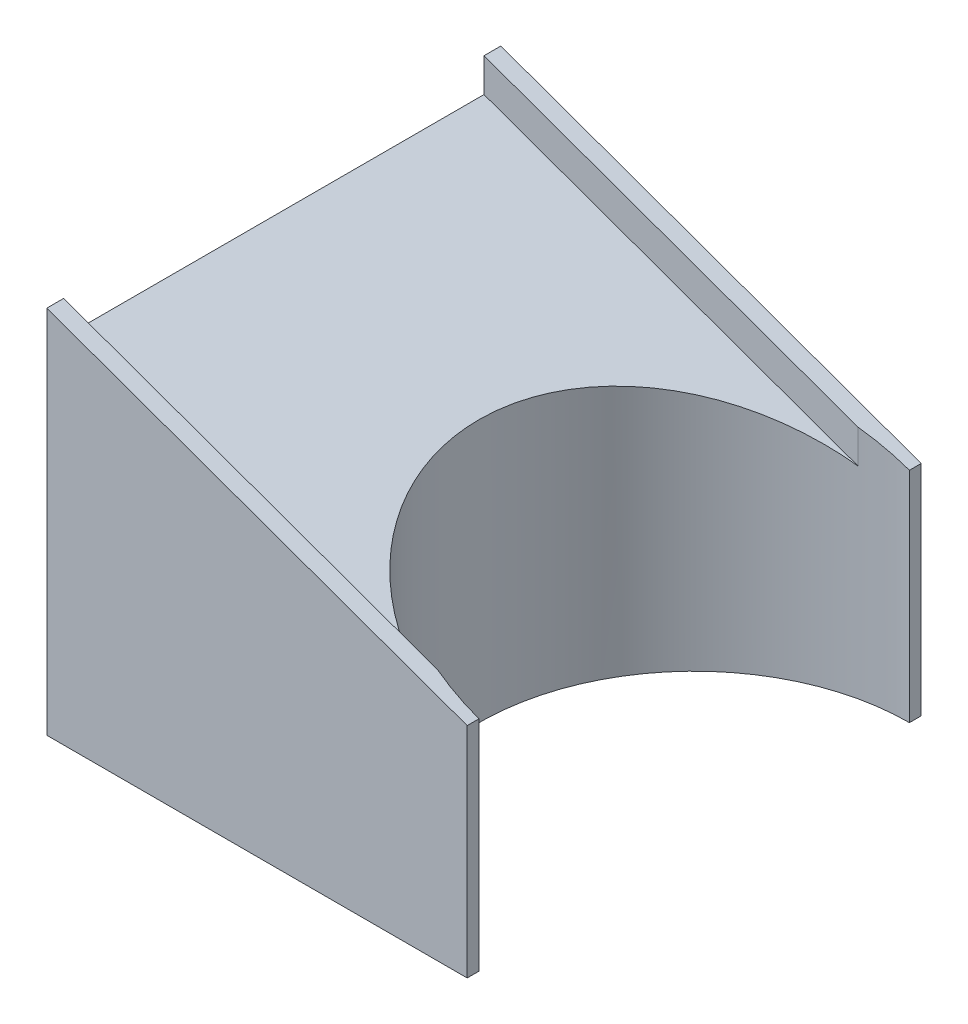
ISO-10303-21;
HEADER;
FILE_DESCRIPTION(('STEP AP214'),'2;1');
FILE_NAME('part.step','',(''),(''),'','','');
FILE_SCHEMA(('AUTOMOTIVE_DESIGN { 1 0 10303 214 1 1 1 1 }'));
ENDSEC;
DATA;
#1=APPLICATION_CONTEXT('core data for automotive mechanical design processes');
#2=APPLICATION_PROTOCOL_DEFINITION('international standard','automotive_design',2000,#1);
#3=PRODUCT_CONTEXT('',#1,'mechanical');
#4=PRODUCT('Part','Part','',(#3));
#5=PRODUCT_RELATED_PRODUCT_CATEGORY('part','',(#4));
#6=PRODUCT_DEFINITION_FORMATION('','',#4);
#7=PRODUCT_DEFINITION_CONTEXT('part definition',#1,'design');
#8=PRODUCT_DEFINITION('design','',#6,#7);
#9=PRODUCT_DEFINITION_SHAPE('','',#8);
#10=(LENGTH_UNIT() NAMED_UNIT(*) SI_UNIT(.MILLI.,.METRE.));
#11=(NAMED_UNIT(*) PLANE_ANGLE_UNIT() SI_UNIT($,.RADIAN.));
#12=(NAMED_UNIT(*) SI_UNIT($,.STERADIAN.) SOLID_ANGLE_UNIT());
#13=UNCERTAINTY_MEASURE_WITH_UNIT(LENGTH_MEASURE(1.E-05),#10,'distance_accuracy_value','');
#14=(GEOMETRIC_REPRESENTATION_CONTEXT(3) GLOBAL_UNCERTAINTY_ASSIGNED_CONTEXT((#13)) GLOBAL_UNIT_ASSIGNED_CONTEXT((#10,
#11,#12)) REPRESENTATION_CONTEXT('',''));
#15=CARTESIAN_POINT('',(0.,0.,0.));
#16=DIRECTION('',(0.,0.,1.));
#17=DIRECTION('',(1.,0.,0.));
#18=AXIS2_PLACEMENT_3D('',#15,#16,#17);
#19=CARTESIAN_POINT('',(125.,55.,62.5));
#20=DIRECTION('',(-1.,0.,0.));
#21=DIRECTION('',(0.,-1.,0.));
#22=AXIS2_PLACEMENT_3D('',#19,#20,#21);
#23=PLANE('',#22);
#24=DIRECTION('',(0.,0.,1.));
#25=VECTOR('',#24,1.);
#26=CARTESIAN_POINT('',(125.,65.,-67.5));
#27=LINE('',#26,#25);
#28=CARTESIAN_POINT('',(125.,65.,-67.5));
#29=VERTEX_POINT('',#28);
#30=CARTESIAN_POINT('',(125.,65.,-64.));
#31=VERTEX_POINT('',#30);
#32=EDGE_CURVE('E186',#29,#31,#27,.T.);
#33=ORIENTED_EDGE('',*,*,#32,.T.);
#34=DIRECTION('',(0.,-1.,0.));
#35=VECTOR('',#34,1.);
#36=CARTESIAN_POINT('',(125.,110.,-64.));
#37=LINE('',#36,#35);
#38=CARTESIAN_POINT('',(125.,0.,-64.));
#39=VERTEX_POINT('',#38);
#40=EDGE_CURVE('E53',#31,#39,#37,.T.);
#41=ORIENTED_EDGE('',*,*,#40,.T.);
#42=DIRECTION('',(0.,0.,-1.));
#43=VECTOR('',#42,1.);
#44=CARTESIAN_POINT('',(125.,0.,62.5));
#45=LINE('',#44,#43);
#46=CARTESIAN_POINT('',(125.,0.,-67.5));
#47=VERTEX_POINT('',#46);
#48=EDGE_CURVE('E239',#39,#47,#45,.T.);
#49=ORIENTED_EDGE('',*,*,#48,.T.);
#50=DIRECTION('',(0.,1.,0.));
#51=VECTOR('',#50,1.);
#52=CARTESIAN_POINT('',(125.,65.,-67.5));
#53=LINE('',#52,#51);
#54=EDGE_CURVE('E169',#47,#29,#53,.T.);
#55=ORIENTED_EDGE('',*,*,#54,.T.);
#56=EDGE_LOOP('',(#33,#41,#49,#55));
#57=FACE_BOUND('',#56,.T.);
#58=ADVANCED_FACE('F38',(#57),#23,.F.);
#59=CARTESIAN_POINT('',(125.,0.,62.5));
#60=DIRECTION('',(0.,1.,0.));
#61=DIRECTION('',(-1.,0.,0.));
#62=AXIS2_PLACEMENT_3D('',#59,#60,#61);
#63=PLANE('',#62);
#64=ORIENTED_EDGE('',*,*,#48,.F.);
#65=CARTESIAN_POINT('',(125.,0.,0.));
#66=DIRECTION('',(0.,-1.,0.));
#67=DIRECTION('',(1.,0.,0.));
#68=AXIS2_PLACEMENT_3D('',#65,#66,#67);
#69=CIRCLE('',#68,64.);
#70=CARTESIAN_POINT('',(125.,0.,64.));
#71=VERTEX_POINT('',#70);
#72=EDGE_CURVE('E146',#71,#39,#69,.T.);
#73=ORIENTED_EDGE('',*,*,#72,.F.);
#74=CARTESIAN_POINT('',(125.,0.,67.5));
#75=VERTEX_POINT('',#74);
#76=EDGE_CURVE('E47',#75,#71,#45,.T.);
#77=ORIENTED_EDGE('',*,*,#76,.F.);
#78=DIRECTION('',(1.,0.,0.));
#79=VECTOR('',#78,1.);
#80=CARTESIAN_POINT('',(125.,0.,67.5));
#81=LINE('',#80,#79);
#82=CARTESIAN_POINT('',(0.,0.,67.5));
#83=VERTEX_POINT('',#82);
#84=EDGE_CURVE('E211',#83,#75,#81,.T.);
#85=ORIENTED_EDGE('',*,*,#84,.F.);
#86=DIRECTION('',(0.,0.,-1.));
#87=VECTOR('',#86,1.);
#88=CARTESIAN_POINT('',(0.,0.,62.5));
#89=LINE('',#88,#87);
#90=CARTESIAN_POINT('',(0.,0.,-67.5));
#91=VERTEX_POINT('',#90);
#92=EDGE_CURVE('E231',#83,#91,#89,.T.);
#93=ORIENTED_EDGE('',*,*,#92,.T.);
#94=DIRECTION('',(1.,0.,0.));
#95=VECTOR('',#94,1.);
#96=CARTESIAN_POINT('',(125.,0.,-67.5));
#97=LINE('',#96,#95);
#98=EDGE_CURVE('E173',#91,#47,#97,.T.);
#99=ORIENTED_EDGE('',*,*,#98,.T.);
#100=EDGE_LOOP('',(#64,#73,#77,#85,#93,#99));
#101=FACE_BOUND('',#100,.T.);
#102=ADVANCED_FACE('F40',(#101),#63,.F.);
#103=ORIENTED_EDGE('',*,*,#76,.T.);
#104=DIRECTION('',(0.,-1.,0.));
#105=VECTOR('',#104,1.);
#106=CARTESIAN_POINT('',(125.,110.,64.));
#107=LINE('',#106,#105);
#108=CARTESIAN_POINT('',(125.,65.,64.));
#109=VERTEX_POINT('',#108);
#110=EDGE_CURVE('E164',#71,#109,#107,.F.);
#111=ORIENTED_EDGE('',*,*,#110,.T.);
#112=DIRECTION('',(0.,0.,-1.));
#113=VECTOR('',#112,1.);
#114=CARTESIAN_POINT('',(125.,65.,67.5));
#115=LINE('',#114,#113);
#116=CARTESIAN_POINT('',(125.,65.,67.5));
#117=VERTEX_POINT('',#116);
#118=EDGE_CURVE('E224',#117,#109,#115,.T.);
#119=ORIENTED_EDGE('',*,*,#118,.F.);
#120=DIRECTION('',(0.,1.,0.));
#121=VECTOR('',#120,1.);
#122=CARTESIAN_POINT('',(125.,65.,67.5));
#123=LINE('',#122,#121);
#124=EDGE_CURVE('E199',#75,#117,#123,.T.);
#125=ORIENTED_EDGE('',*,*,#124,.F.);
#126=EDGE_LOOP('',(#103,#111,#119,#125));
#127=FACE_BOUND('',#126,.T.);
#128=ADVANCED_FACE('F280',(#127),#23,.F.);
#129=CARTESIAN_POINT('',(0.,100.,62.5));
#130=DIRECTION('',(-0.338719468272742,-0.940887411868727,0.));
#131=DIRECTION('',(0.940887411868727,-0.338719468272742,0.));
#132=AXIS2_PLACEMENT_3D('',#129,#130,#131);
#133=PLANE('',#132);
#134=DIRECTION('',(-0.940887411868727,0.338719468272742,0.));
#135=VECTOR('',#134,1.);
#136=CARTESIAN_POINT('',(0.,100.,62.5));
#137=LINE('',#136,#135);
#138=CARTESIAN_POINT('',(111.225022686044,59.9589918330241,62.5));
#139=VERTEX_POINT('',#138);
#140=CARTESIAN_POINT('',(0.,100.,62.5));
#141=VERTEX_POINT('',#140);
#142=EDGE_CURVE('E228',#139,#141,#137,.T.);
#143=ORIENTED_EDGE('',*,*,#142,.F.);
#144=CARTESIAN_POINT('',(125.,55.,0.));
#145=DIRECTION('',(-0.338719468272742,-0.940887411868727,0.));
#146=DIRECTION('',(0.940887411868727,-0.338719468272742,0.));
#147=AXIS2_PLACEMENT_3D('',#144,#145,#146);
#148=ELLIPSE('',#147,68.0208909086025,64.);
#149=CARTESIAN_POINT('',(111.225022686044,59.9589918330241,-62.5));
#150=VERTEX_POINT('',#149);
#151=EDGE_CURVE('E152',#139,#150,#148,.T.);
#152=ORIENTED_EDGE('',*,*,#151,.T.);
#153=DIRECTION('',(-0.940887411868727,0.338719468272742,0.));
#154=VECTOR('',#153,1.);
#155=CARTESIAN_POINT('',(0.,100.,-62.5));
#156=LINE('',#155,#154);
#157=CARTESIAN_POINT('',(0.,100.,-62.5));
#158=VERTEX_POINT('',#157);
#159=EDGE_CURVE('E61',#150,#158,#156,.T.);
#160=ORIENTED_EDGE('',*,*,#159,.T.);
#161=DIRECTION('',(0.,0.,-1.));
#162=VECTOR('',#161,1.);
#163=CARTESIAN_POINT('',(0.,100.,62.5));
#164=LINE('',#163,#162);
#165=EDGE_CURVE('E236',#141,#158,#164,.T.);
#166=ORIENTED_EDGE('',*,*,#165,.F.);
#167=EDGE_LOOP('',(#143,#152,#160,#166));
#168=FACE_BOUND('',#167,.T.);
#169=ADVANCED_FACE('F271',(#168),#133,.F.);
#170=CARTESIAN_POINT('',(0.,0.,62.5));
#171=DIRECTION('',(1.,0.,0.));
#172=DIRECTION('',(0.,0.,-1.));
#173=AXIS2_PLACEMENT_3D('',#170,#171,#172);
#174=PLANE('',#173);
#175=CARTESIAN_POINT('',(0.,55.,0.));
#176=DIRECTION('',(-1.,0.,0.));
#177=DIRECTION('',(0.,0.,1.));
#178=AXIS2_PLACEMENT_3D('',#175,#176,#177);
#179=CIRCLE('',#178,2.38759999999999);
#180=CARTESIAN_POINT('',(0.,55.,2.38759999999999));
#181=VERTEX_POINT('',#180);
#182=EDGE_CURVE('E133',#181,#181,#179,.T.);
#183=ORIENTED_EDGE('',*,*,#182,.F.);
#184=EDGE_LOOP('',(#183));
#185=FACE_BOUND('',#184,.T.);
#186=CARTESIAN_POINT('',(0.,20.,0.));
#187=DIRECTION('',(-1.,0.,0.));
#188=DIRECTION('',(0.,0.,1.));
#189=AXIS2_PLACEMENT_3D('',#186,#187,#188);
#190=CIRCLE('',#189,2.38759999999999);
#191=CARTESIAN_POINT('',(0.,20.,2.3876));
#192=VERTEX_POINT('',#191);
#193=EDGE_CURVE('E132',#192,#192,#190,.T.);
#194=ORIENTED_EDGE('',*,*,#193,.F.);
#195=EDGE_LOOP('',(#194));
#196=FACE_BOUND('',#195,.T.);
#197=ORIENTED_EDGE('',*,*,#165,.T.);
#198=DIRECTION('',(0.,-1.,0.));
#199=VECTOR('',#198,1.);
#200=CARTESIAN_POINT('',(0.,0.,-62.5));
#201=LINE('',#200,#199);
#202=CARTESIAN_POINT('',(0.,110.,-62.5));
#203=VERTEX_POINT('',#202);
#204=EDGE_CURVE('E168',#203,#158,#201,.T.);
#205=ORIENTED_EDGE('',*,*,#204,.F.);
#206=DIRECTION('',(0.,0.,1.));
#207=VECTOR('',#206,1.);
#208=CARTESIAN_POINT('',(0.,110.,-67.5));
#209=LINE('',#208,#207);
#210=CARTESIAN_POINT('',(0.,110.,-67.5));
#211=VERTEX_POINT('',#210);
#212=EDGE_CURVE('E194',#211,#203,#209,.T.);
#213=ORIENTED_EDGE('',*,*,#212,.F.);
#214=DIRECTION('',(0.,-1.,0.));
#215=VECTOR('',#214,1.);
#216=CARTESIAN_POINT('',(0.,0.,-67.5));
#217=LINE('',#216,#215);
#218=EDGE_CURVE('E178',#211,#91,#217,.T.);
#219=ORIENTED_EDGE('',*,*,#218,.T.);
#220=ORIENTED_EDGE('',*,*,#92,.F.);
#221=DIRECTION('',(0.,-1.,0.));
#222=VECTOR('',#221,1.);
#223=CARTESIAN_POINT('',(0.,0.,67.5));
#224=LINE('',#223,#222);
#225=CARTESIAN_POINT('',(0.,110.,67.5));
#226=VERTEX_POINT('',#225);
#227=EDGE_CURVE('E207',#226,#83,#224,.T.);
#228=ORIENTED_EDGE('',*,*,#227,.F.);
#229=DIRECTION('',(0.,0.,-1.));
#230=VECTOR('',#229,1.);
#231=CARTESIAN_POINT('',(0.,110.,67.5));
#232=LINE('',#231,#230);
#233=CARTESIAN_POINT('',(0.,110.,62.5));
#234=VERTEX_POINT('',#233);
#235=EDGE_CURVE('E215',#226,#234,#232,.T.);
#236=ORIENTED_EDGE('',*,*,#235,.T.);
#237=DIRECTION('',(0.,-1.,0.));
#238=VECTOR('',#237,1.);
#239=CARTESIAN_POINT('',(0.,0.,62.5));
#240=LINE('',#239,#238);
#241=EDGE_CURVE('E204',#234,#141,#240,.T.);
#242=ORIENTED_EDGE('',*,*,#241,.T.);
#243=EDGE_LOOP('',(#197,#205,#213,#219,#220,#228,#236,#242));
#244=FACE_BOUND('',#243,.T.);
#245=ADVANCED_FACE('F258',(#185,#196,#244),#174,.F.);
#246=CARTESIAN_POINT('',(0.,110.,67.5));
#247=DIRECTION('',(-0.338719468272742,-0.940887411868727,0.));
#248=DIRECTION('',(0.940887411868727,-0.338719468272742,0.));
#249=AXIS2_PLACEMENT_3D('',#246,#247,#248);
#250=PLANE('',#249);
#251=ORIENTED_EDGE('',*,*,#118,.T.);
#252=CARTESIAN_POINT('',(125.,65.,0.));
#253=DIRECTION('',(-0.338719468272742,-0.940887411868727,0.));
#254=DIRECTION('',(0.940887411868727,-0.338719468272742,0.));
#255=AXIS2_PLACEMENT_3D('',#252,#253,#254);
#256=ELLIPSE('',#255,68.0208909086025,64.);
#257=CARTESIAN_POINT('',(111.225022686044,69.9589918330242,62.5));
#258=VERTEX_POINT('',#257);
#259=EDGE_CURVE('E160',#109,#258,#256,.T.);
#260=ORIENTED_EDGE('',*,*,#259,.T.);
#261=DIRECTION('',(-0.940887411868727,0.338719468272741,0.));
#262=VECTOR('',#261,1.);
#263=CARTESIAN_POINT('',(0.,110.,62.5));
#264=LINE('',#263,#262);
#265=EDGE_CURVE('E198',#258,#234,#264,.T.);
#266=ORIENTED_EDGE('',*,*,#265,.T.);
#267=ORIENTED_EDGE('',*,*,#235,.F.);
#268=DIRECTION('',(-0.940887411868727,0.338719468272741,0.));
#269=VECTOR('',#268,1.);
#270=CARTESIAN_POINT('',(0.,110.,67.5));
#271=LINE('',#270,#269);
#272=EDGE_CURVE('E203',#117,#226,#271,.T.);
#273=ORIENTED_EDGE('',*,*,#272,.F.);
#274=EDGE_LOOP('',(#251,#260,#266,#267,#273));
#275=FACE_BOUND('',#274,.T.);
#276=ADVANCED_FACE('F264',(#275),#250,.F.);
#277=CARTESIAN_POINT('',(0.,0.,67.5));
#278=DIRECTION('',(0.,0.,-1.));
#279=DIRECTION('',(-1.,0.,0.));
#280=AXIS2_PLACEMENT_3D('',#277,#278,#279);
#281=PLANE('',#280);
#282=ORIENTED_EDGE('',*,*,#124,.T.);
#283=ORIENTED_EDGE('',*,*,#272,.T.);
#284=ORIENTED_EDGE('',*,*,#227,.T.);
#285=ORIENTED_EDGE('',*,*,#84,.T.);
#286=EDGE_LOOP('',(#282,#283,#284,#285));
#287=FACE_BOUND('',#286,.T.);
#288=ADVANCED_FACE('F260',(#287),#281,.F.);
#289=CARTESIAN_POINT('',(0.,0.,62.5));
#290=DIRECTION('',(0.,0.,-1.));
#291=DIRECTION('',(-1.,0.,0.));
#292=AXIS2_PLACEMENT_3D('',#289,#290,#291);
#293=PLANE('',#292);
#294=DIRECTION('',(0.,-1.,0.));
#295=VECTOR('',#294,1.);
#296=CARTESIAN_POINT('',(111.225022686044,110.,62.5));
#297=LINE('',#296,#295);
#298=EDGE_CURVE('E157',#139,#258,#297,.F.);
#299=ORIENTED_EDGE('',*,*,#298,.F.);
#300=ORIENTED_EDGE('',*,*,#142,.T.);
#301=ORIENTED_EDGE('',*,*,#241,.F.);
#302=ORIENTED_EDGE('',*,*,#265,.F.);
#303=EDGE_LOOP('',(#299,#300,#301,#302));
#304=FACE_BOUND('',#303,.T.);
#305=ADVANCED_FACE('F269',(#304),#293,.T.);
#306=CARTESIAN_POINT('',(0.,0.,-62.5));
#307=DIRECTION('',(0.,0.,1.));
#308=DIRECTION('',(-1.,0.,0.));
#309=AXIS2_PLACEMENT_3D('',#306,#307,#308);
#310=PLANE('',#309);
#311=DIRECTION('',(0.,-1.,0.));
#312=VECTOR('',#311,1.);
#313=CARTESIAN_POINT('',(111.225022686044,110.,-62.5));
#314=LINE('',#313,#312);
#315=CARTESIAN_POINT('',(111.225022686044,69.9589918330242,-62.5));
#316=VERTEX_POINT('',#315);
#317=EDGE_CURVE('E149',#316,#150,#314,.T.);
#318=ORIENTED_EDGE('',*,*,#317,.F.);
#319=DIRECTION('',(-0.940887411868727,0.338719468272741,0.));
#320=VECTOR('',#319,1.);
#321=CARTESIAN_POINT('',(0.,110.,-62.5));
#322=LINE('',#321,#320);
#323=EDGE_CURVE('E174',#316,#203,#322,.T.);
#324=ORIENTED_EDGE('',*,*,#323,.T.);
#325=ORIENTED_EDGE('',*,*,#204,.T.);
#326=ORIENTED_EDGE('',*,*,#159,.F.);
#327=EDGE_LOOP('',(#318,#324,#325,#326));
#328=FACE_BOUND('',#327,.T.);
#329=ADVANCED_FACE('F275',(#328),#310,.T.);
#330=CARTESIAN_POINT('',(0.,110.,-67.5));
#331=DIRECTION('',(0.338719468272742,0.940887411868727,0.));
#332=DIRECTION('',(-0.940887411868727,0.338719468272742,0.));
#333=AXIS2_PLACEMENT_3D('',#330,#331,#332);
#334=PLANE('',#333);
#335=CARTESIAN_POINT('',(125.,65.,0.));
#336=DIRECTION('',(0.338719468272742,0.940887411868727,0.));
#337=DIRECTION('',(0.940887411868727,-0.338719468272742,0.));
#338=AXIS2_PLACEMENT_3D('',#335,#336,#337);
#339=ELLIPSE('',#338,68.0208909086025,64.);
#340=EDGE_CURVE('E11',#31,#316,#339,.T.);
#341=ORIENTED_EDGE('',*,*,#340,.F.);
#342=ORIENTED_EDGE('',*,*,#32,.F.);
#343=DIRECTION('',(-0.940887411868727,0.338719468272741,0.));
#344=VECTOR('',#343,1.);
#345=CARTESIAN_POINT('',(0.,110.,-67.5));
#346=LINE('',#345,#344);
#347=EDGE_CURVE('E182',#29,#211,#346,.T.);
#348=ORIENTED_EDGE('',*,*,#347,.T.);
#349=ORIENTED_EDGE('',*,*,#212,.T.);
#350=ORIENTED_EDGE('',*,*,#323,.F.);
#351=EDGE_LOOP('',(#341,#342,#348,#349,#350));
#352=FACE_BOUND('',#351,.T.);
#353=ADVANCED_FACE('F278',(#352),#334,.T.);
#354=CARTESIAN_POINT('',(0.,0.,-67.5));
#355=DIRECTION('',(0.,0.,1.));
#356=DIRECTION('',(-1.,0.,0.));
#357=AXIS2_PLACEMENT_3D('',#354,#355,#356);
#358=PLANE('',#357);
#359=ORIENTED_EDGE('',*,*,#54,.F.);
#360=ORIENTED_EDGE('',*,*,#98,.F.);
#361=ORIENTED_EDGE('',*,*,#218,.F.);
#362=ORIENTED_EDGE('',*,*,#347,.F.);
#363=EDGE_LOOP('',(#359,#360,#361,#362));
#364=FACE_BOUND('',#363,.T.);
#365=ADVANCED_FACE('F253',(#364),#358,.F.);
#366=CARTESIAN_POINT('',(125.,110.,0.));
#367=DIRECTION('',(0.,-1.,0.));
#368=DIRECTION('',(1.,0.,0.));
#369=AXIS2_PLACEMENT_3D('',#366,#367,#368);
#370=CYLINDRICAL_SURFACE('',#369,64.);
#371=ORIENTED_EDGE('',*,*,#72,.T.);
#372=ORIENTED_EDGE('',*,*,#40,.F.);
#373=ORIENTED_EDGE('',*,*,#340,.T.);
#374=ORIENTED_EDGE('',*,*,#317,.T.);
#375=ORIENTED_EDGE('',*,*,#151,.F.);
#376=ORIENTED_EDGE('',*,*,#298,.T.);
#377=ORIENTED_EDGE('',*,*,#259,.F.);
#378=ORIENTED_EDGE('',*,*,#110,.F.);
#379=EDGE_LOOP('',(#371,#372,#373,#374,#375,#376,#377,#378));
#380=FACE_BOUND('',#379,.T.);
#381=ADVANCED_FACE('F279',(#380),#370,.F.);
#382=CARTESIAN_POINT('',(12.7,20.,0.));
#383=DIRECTION('',(-1.,0.,0.));
#384=DIRECTION('',(0.,0.,1.));
#385=AXIS2_PLACEMENT_3D('',#382,#383,#384);
#386=CONICAL_SURFACE('',#385,2.38759999999998,1.02974425867665);
#387=CARTESIAN_POINT('',(14.1346148139902,20.,0.));
#388=VERTEX_POINT('',#387);
#389=VERTEX_LOOP('',#388);
#390=FACE_BOUND('',#389,.T.);
#391=CARTESIAN_POINT('',(12.7,20.,0.));
#392=DIRECTION('',(-1.,0.,0.));
#393=DIRECTION('',(0.,0.,1.));
#394=AXIS2_PLACEMENT_3D('',#391,#392,#393);
#395=CIRCLE('',#394,2.38759999999998);
#396=CARTESIAN_POINT('',(12.7,20.,2.3876));
#397=VERTEX_POINT('',#396);
#398=EDGE_CURVE('E138',#397,#397,#395,.T.);
#399=ORIENTED_EDGE('',*,*,#398,.T.);
#400=EDGE_LOOP('',(#399));
#401=FACE_BOUND('',#400,.T.);
#402=ADVANCED_FACE('F357',(#390,#401),#386,.F.);
#403=CARTESIAN_POINT('',(0.,20.,0.));
#404=DIRECTION('',(-1.,0.,0.));
#405=DIRECTION('',(0.,0.,1.));
#406=AXIS2_PLACEMENT_3D('',#403,#404,#405);
#407=CYLINDRICAL_SURFACE('',#406,2.38759999999999);
#408=ORIENTED_EDGE('',*,*,#398,.F.);
#409=EDGE_LOOP('',(#408));
#410=FACE_BOUND('',#409,.T.);
#411=ORIENTED_EDGE('',*,*,#193,.T.);
#412=EDGE_LOOP('',(#411));
#413=FACE_BOUND('',#412,.T.);
#414=ADVANCED_FACE('F125',(#410,#413),#407,.F.);
#415=CARTESIAN_POINT('',(12.7,55.,0.));
#416=DIRECTION('',(-1.,0.,0.));
#417=DIRECTION('',(0.,0.,1.));
#418=AXIS2_PLACEMENT_3D('',#415,#416,#417);
#419=CONICAL_SURFACE('',#418,2.38759999999998,1.02974425867665);
#420=CARTESIAN_POINT('',(14.1346148139902,55.,0.));
#421=VERTEX_POINT('',#420);
#422=VERTEX_LOOP('',#421);
#423=FACE_BOUND('',#422,.T.);
#424=CARTESIAN_POINT('',(12.7,55.,0.));
#425=DIRECTION('',(-1.,0.,0.));
#426=DIRECTION('',(0.,0.,1.));
#427=AXIS2_PLACEMENT_3D('',#424,#425,#426);
#428=CIRCLE('',#427,2.38759999999998);
#429=CARTESIAN_POINT('',(12.7,55.,2.38759999999998));
#430=VERTEX_POINT('',#429);
#431=EDGE_CURVE('E129',#430,#430,#428,.T.);
#432=ORIENTED_EDGE('',*,*,#431,.T.);
#433=EDGE_LOOP('',(#432));
#434=FACE_BOUND('',#433,.T.);
#435=ADVANCED_FACE('F121',(#423,#434),#419,.F.);
#436=CARTESIAN_POINT('',(0.,55.,0.));
#437=DIRECTION('',(-1.,0.,0.));
#438=DIRECTION('',(0.,0.,1.));
#439=AXIS2_PLACEMENT_3D('',#436,#437,#438);
#440=CYLINDRICAL_SURFACE('',#439,2.38759999999999);
#441=ORIENTED_EDGE('',*,*,#431,.F.);
#442=EDGE_LOOP('',(#441));
#443=FACE_BOUND('',#442,.T.);
#444=ORIENTED_EDGE('',*,*,#182,.T.);
#445=EDGE_LOOP('',(#444));
#446=FACE_BOUND('',#445,.T.);
#447=ADVANCED_FACE('F124',(#443,#446),#440,.F.);
#448=CLOSED_SHELL('',(#58,#102,#128,#169,#245,#276,#288,#305,#329,#353,#365,#381,#402,#414,#435,#447));
#449=MANIFOLD_SOLID_BREP('B2',#448);
#450=ADVANCED_BREP_SHAPE_REPRESENTATION('',(#18,#449),#14);
#451=SHAPE_DEFINITION_REPRESENTATION(#9,#450);
ENDSEC;
END-ISO-10303-21;
